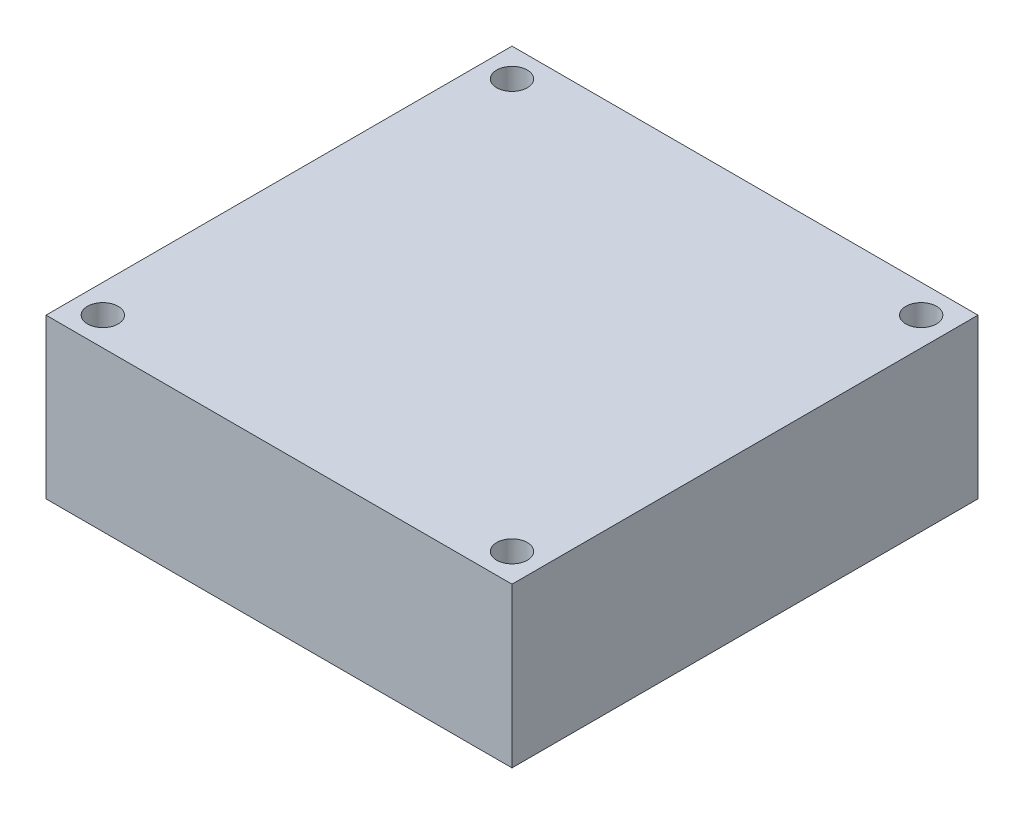
ISO-10303-21;
HEADER;
FILE_DESCRIPTION(('STEP AP214'),'2;1');
FILE_NAME('part.step','',(''),(''),'','','');
FILE_SCHEMA(('AUTOMOTIVE_DESIGN { 1 0 10303 214 1 1 1 1 }'));
ENDSEC;
DATA;
#1=APPLICATION_CONTEXT('core data for automotive mechanical design processes');
#2=APPLICATION_PROTOCOL_DEFINITION('international standard','automotive_design',2000,#1);
#3=PRODUCT_CONTEXT('',#1,'mechanical');
#4=PRODUCT('Part','Part','',(#3));
#5=PRODUCT_RELATED_PRODUCT_CATEGORY('part','',(#4));
#6=PRODUCT_DEFINITION_FORMATION('','',#4);
#7=PRODUCT_DEFINITION_CONTEXT('part definition',#1,'design');
#8=PRODUCT_DEFINITION('design','',#6,#7);
#9=PRODUCT_DEFINITION_SHAPE('','',#8);
#10=(LENGTH_UNIT() NAMED_UNIT(*) SI_UNIT(.MILLI.,.METRE.));
#11=(NAMED_UNIT(*) PLANE_ANGLE_UNIT() SI_UNIT($,.RADIAN.));
#12=(NAMED_UNIT(*) SI_UNIT($,.STERADIAN.) SOLID_ANGLE_UNIT());
#13=UNCERTAINTY_MEASURE_WITH_UNIT(LENGTH_MEASURE(1.E-05),#10,'distance_accuracy_value','');
#14=(GEOMETRIC_REPRESENTATION_CONTEXT(3) GLOBAL_UNCERTAINTY_ASSIGNED_CONTEXT((#13)) GLOBAL_UNIT_ASSIGNED_CONTEXT((#10,
#11,#12)) REPRESENTATION_CONTEXT('',''));
#15=CARTESIAN_POINT('',(0.,0.,0.));
#16=DIRECTION('',(0.,0.,1.));
#17=DIRECTION('',(1.,0.,0.));
#18=AXIS2_PLACEMENT_3D('',#15,#16,#17);
#19=CARTESIAN_POINT('',(-20.5,14.,20.5));
#20=DIRECTION('',(0.,0.,-1.));
#21=DIRECTION('',(-1.,0.,0.));
#22=AXIS2_PLACEMENT_3D('',#19,#20,#21);
#23=PLANE('',#22);
#24=DIRECTION('',(1.,0.,0.));
#25=VECTOR('',#24,1.);
#26=CARTESIAN_POINT('',(-20.5,0.,20.5));
#27=LINE('',#26,#25);
#28=CARTESIAN_POINT('',(-20.5,0.,20.5));
#29=VERTEX_POINT('',#28);
#30=CARTESIAN_POINT('',(20.5,0.,20.5));
#31=VERTEX_POINT('',#30);
#32=EDGE_CURVE('E113',#29,#31,#27,.T.);
#33=ORIENTED_EDGE('',*,*,#32,.T.);
#34=DIRECTION('',(0.,-1.,0.));
#35=VECTOR('',#34,1.);
#36=CARTESIAN_POINT('',(20.5,14.,20.5));
#37=LINE('',#36,#35);
#38=CARTESIAN_POINT('',(20.5,14.,20.5));
#39=VERTEX_POINT('',#38);
#40=EDGE_CURVE('E11',#39,#31,#37,.T.);
#41=ORIENTED_EDGE('',*,*,#40,.F.);
#42=DIRECTION('',(1.,0.,0.));
#43=VECTOR('',#42,1.);
#44=CARTESIAN_POINT('',(-20.5,14.,20.5));
#45=LINE('',#44,#43);
#46=CARTESIAN_POINT('',(-20.5,14.,20.5));
#47=VERTEX_POINT('',#46);
#48=EDGE_CURVE('E95',#47,#39,#45,.T.);
#49=ORIENTED_EDGE('',*,*,#48,.F.);
#50=DIRECTION('',(0.,-1.,0.));
#51=VECTOR('',#50,1.);
#52=CARTESIAN_POINT('',(-20.5,14.,20.5));
#53=LINE('',#52,#51);
#54=EDGE_CURVE('E62',#47,#29,#53,.T.);
#55=ORIENTED_EDGE('',*,*,#54,.T.);
#56=EDGE_LOOP('',(#33,#41,#49,#55));
#57=FACE_BOUND('',#56,.T.);
#58=ADVANCED_FACE('F45',(#57),#23,.F.);
#59=CARTESIAN_POINT('',(20.5,14.,20.5));
#60=DIRECTION('',(-1.,0.,0.));
#61=DIRECTION('',(0.,0.,1.));
#62=AXIS2_PLACEMENT_3D('',#59,#60,#61);
#63=PLANE('',#62);
#64=DIRECTION('',(0.,0.,-1.));
#65=VECTOR('',#64,1.);
#66=CARTESIAN_POINT('',(20.5,0.,20.5));
#67=LINE('',#66,#65);
#68=CARTESIAN_POINT('',(20.5,0.,-20.5));
#69=VERTEX_POINT('',#68);
#70=EDGE_CURVE('E101',#31,#69,#67,.T.);
#71=ORIENTED_EDGE('',*,*,#70,.T.);
#72=DIRECTION('',(0.,-1.,0.));
#73=VECTOR('',#72,1.);
#74=CARTESIAN_POINT('',(20.5,14.,-20.5));
#75=LINE('',#74,#73);
#76=CARTESIAN_POINT('',(20.5,14.,-20.5));
#77=VERTEX_POINT('',#76);
#78=EDGE_CURVE('E54',#77,#69,#75,.T.);
#79=ORIENTED_EDGE('',*,*,#78,.F.);
#80=DIRECTION('',(0.,0.,-1.));
#81=VECTOR('',#80,1.);
#82=CARTESIAN_POINT('',(20.5,14.,20.5));
#83=LINE('',#82,#81);
#84=EDGE_CURVE('E87',#39,#77,#83,.T.);
#85=ORIENTED_EDGE('',*,*,#84,.F.);
#86=ORIENTED_EDGE('',*,*,#40,.T.);
#87=EDGE_LOOP('',(#71,#79,#85,#86));
#88=FACE_BOUND('',#87,.T.);
#89=ADVANCED_FACE('F100',(#88),#63,.F.);
#90=CARTESIAN_POINT('',(-20.5,14.,-20.5));
#91=DIRECTION('',(0.,0.,-1.));
#92=DIRECTION('',(-1.,0.,0.));
#93=AXIS2_PLACEMENT_3D('',#90,#91,#92);
#94=PLANE('',#93);
#95=DIRECTION('',(1.,0.,0.));
#96=VECTOR('',#95,1.);
#97=CARTESIAN_POINT('',(-20.5,0.,-20.5));
#98=LINE('',#97,#96);
#99=CARTESIAN_POINT('',(-20.5,0.,-20.5));
#100=VERTEX_POINT('',#99);
#101=EDGE_CURVE('E119',#100,#69,#98,.T.);
#102=ORIENTED_EDGE('',*,*,#101,.F.);
#103=DIRECTION('',(0.,-1.,0.));
#104=VECTOR('',#103,1.);
#105=CARTESIAN_POINT('',(-20.5,14.,-20.5));
#106=LINE('',#105,#104);
#107=CARTESIAN_POINT('',(-20.5,14.,-20.5));
#108=VERTEX_POINT('',#107);
#109=EDGE_CURVE('E76',#108,#100,#106,.T.);
#110=ORIENTED_EDGE('',*,*,#109,.F.);
#111=DIRECTION('',(1.,0.,0.));
#112=VECTOR('',#111,1.);
#113=CARTESIAN_POINT('',(-20.5,14.,-20.5));
#114=LINE('',#113,#112);
#115=EDGE_CURVE('E94',#108,#77,#114,.T.);
#116=ORIENTED_EDGE('',*,*,#115,.T.);
#117=ORIENTED_EDGE('',*,*,#78,.T.);
#118=EDGE_LOOP('',(#102,#110,#116,#117));
#119=FACE_BOUND('',#118,.T.);
#120=ADVANCED_FACE('F105',(#119),#94,.T.);
#121=CARTESIAN_POINT('',(-20.5,14.,20.5));
#122=DIRECTION('',(-1.,0.,0.));
#123=DIRECTION('',(0.,0.,1.));
#124=AXIS2_PLACEMENT_3D('',#121,#122,#123);
#125=PLANE('',#124);
#126=DIRECTION('',(0.,0.,-1.));
#127=VECTOR('',#126,1.);
#128=CARTESIAN_POINT('',(-20.5,0.,20.5));
#129=LINE('',#128,#127);
#130=EDGE_CURVE('E122',#29,#100,#129,.T.);
#131=ORIENTED_EDGE('',*,*,#130,.F.);
#132=ORIENTED_EDGE('',*,*,#54,.F.);
#133=DIRECTION('',(0.,0.,-1.));
#134=VECTOR('',#133,1.);
#135=CARTESIAN_POINT('',(-20.5,14.,20.5));
#136=LINE('',#135,#134);
#137=EDGE_CURVE('E107',#47,#108,#136,.T.);
#138=ORIENTED_EDGE('',*,*,#137,.T.);
#139=ORIENTED_EDGE('',*,*,#109,.T.);
#140=EDGE_LOOP('',(#131,#132,#138,#139));
#141=FACE_BOUND('',#140,.T.);
#142=ADVANCED_FACE('F169',(#141),#125,.T.);
#143=CARTESIAN_POINT('',(0.,14.,0.));
#144=DIRECTION('',(0.,1.,0.));
#145=DIRECTION('',(0.,0.,1.));
#146=AXIS2_PLACEMENT_3D('',#143,#144,#145);
#147=PLANE('',#146);
#148=CARTESIAN_POINT('',(-18.0000000000002,14.,17.9999999999998));
#149=DIRECTION('',(0.,1.,0.));
#150=DIRECTION('',(0.,0.,1.));
#151=AXIS2_PLACEMENT_3D('',#148,#149,#150);
#152=CIRCLE('',#151,1.35);
#153=CARTESIAN_POINT('',(-18.0000000000002,14.,19.3499999999998));
#154=VERTEX_POINT('',#153);
#155=EDGE_CURVE('E144',#154,#154,#152,.T.);
#156=ORIENTED_EDGE('',*,*,#155,.F.);
#157=EDGE_LOOP('',(#156));
#158=FACE_BOUND('',#157,.T.);
#159=CARTESIAN_POINT('',(17.9999999999999,14.,18.0000000000001));
#160=DIRECTION('',(0.,1.,0.));
#161=DIRECTION('',(0.,0.,1.));
#162=AXIS2_PLACEMENT_3D('',#159,#160,#161);
#163=CIRCLE('',#162,1.35);
#164=CARTESIAN_POINT('',(17.9999999999999,14.,19.3500000000001));
#165=VERTEX_POINT('',#164);
#166=EDGE_CURVE('E152',#165,#165,#163,.T.);
#167=ORIENTED_EDGE('',*,*,#166,.F.);
#168=EDGE_LOOP('',(#167));
#169=FACE_BOUND('',#168,.T.);
#170=CARTESIAN_POINT('',(18.0000000000001,14.,-17.9999999999999));
#171=DIRECTION('',(0.,1.,0.));
#172=DIRECTION('',(0.,0.,1.));
#173=AXIS2_PLACEMENT_3D('',#170,#171,#172);
#174=CIRCLE('',#173,1.35);
#175=CARTESIAN_POINT('',(18.0000000000001,14.,-16.6499999999999));
#176=VERTEX_POINT('',#175);
#177=EDGE_CURVE('E136',#176,#176,#174,.T.);
#178=ORIENTED_EDGE('',*,*,#177,.F.);
#179=EDGE_LOOP('',(#178));
#180=FACE_BOUND('',#179,.T.);
#181=CARTESIAN_POINT('',(-18.,14.,-18.));
#182=DIRECTION('',(0.,1.,0.));
#183=DIRECTION('',(0.,0.,1.));
#184=AXIS2_PLACEMENT_3D('',#181,#182,#183);
#185=CIRCLE('',#184,1.35);
#186=CARTESIAN_POINT('',(-18.,14.,-16.65));
#187=VERTEX_POINT('',#186);
#188=EDGE_CURVE('E132',#187,#187,#185,.T.);
#189=ORIENTED_EDGE('',*,*,#188,.F.);
#190=EDGE_LOOP('',(#189));
#191=FACE_BOUND('',#190,.T.);
#192=ORIENTED_EDGE('',*,*,#48,.T.);
#193=ORIENTED_EDGE('',*,*,#84,.T.);
#194=ORIENTED_EDGE('',*,*,#115,.F.);
#195=ORIENTED_EDGE('',*,*,#137,.F.);
#196=EDGE_LOOP('',(#192,#193,#194,#195));
#197=FACE_BOUND('',#196,.T.);
#198=ADVANCED_FACE('F91',(#158,#169,#180,#191,#197),#147,.T.);
#199=CARTESIAN_POINT('',(0.,0.,0.));
#200=DIRECTION('',(0.,1.,0.));
#201=DIRECTION('',(0.,0.,1.));
#202=AXIS2_PLACEMENT_3D('',#199,#200,#201);
#203=PLANE('',#202);
#204=CARTESIAN_POINT('',(-18.0000000000002,0.,17.9999999999998));
#205=DIRECTION('',(0.,1.,0.));
#206=DIRECTION('',(0.,0.,1.));
#207=AXIS2_PLACEMENT_3D('',#204,#205,#206);
#208=CIRCLE('',#207,1.35);
#209=CARTESIAN_POINT('',(-18.0000000000002,0.,19.3499999999998));
#210=VERTEX_POINT('',#209);
#211=EDGE_CURVE('E140',#210,#210,#208,.T.);
#212=ORIENTED_EDGE('',*,*,#211,.T.);
#213=EDGE_LOOP('',(#212));
#214=FACE_BOUND('',#213,.T.);
#215=CARTESIAN_POINT('',(17.9999999999999,0.,18.0000000000001));
#216=DIRECTION('',(0.,1.,0.));
#217=DIRECTION('',(0.,0.,1.));
#218=AXIS2_PLACEMENT_3D('',#215,#216,#217);
#219=CIRCLE('',#218,1.35);
#220=CARTESIAN_POINT('',(17.9999999999999,0.,19.3500000000001));
#221=VERTEX_POINT('',#220);
#222=EDGE_CURVE('E148',#221,#221,#219,.T.);
#223=ORIENTED_EDGE('',*,*,#222,.T.);
#224=EDGE_LOOP('',(#223));
#225=FACE_BOUND('',#224,.T.);
#226=CARTESIAN_POINT('',(18.0000000000001,0.,-17.9999999999999));
#227=DIRECTION('',(0.,1.,0.));
#228=DIRECTION('',(0.,0.,1.));
#229=AXIS2_PLACEMENT_3D('',#226,#227,#228);
#230=CIRCLE('',#229,1.35);
#231=CARTESIAN_POINT('',(18.0000000000001,0.,-16.6499999999999));
#232=VERTEX_POINT('',#231);
#233=EDGE_CURVE('E156',#232,#232,#230,.T.);
#234=ORIENTED_EDGE('',*,*,#233,.T.);
#235=EDGE_LOOP('',(#234));
#236=FACE_BOUND('',#235,.T.);
#237=CARTESIAN_POINT('',(-18.,0.,-18.));
#238=DIRECTION('',(0.,1.,0.));
#239=DIRECTION('',(0.,0.,1.));
#240=AXIS2_PLACEMENT_3D('',#237,#238,#239);
#241=CIRCLE('',#240,1.35);
#242=CARTESIAN_POINT('',(-18.,0.,-16.65));
#243=VERTEX_POINT('',#242);
#244=EDGE_CURVE('E116',#243,#243,#241,.T.);
#245=ORIENTED_EDGE('',*,*,#244,.T.);
#246=EDGE_LOOP('',(#245));
#247=FACE_BOUND('',#246,.T.);
#248=ORIENTED_EDGE('',*,*,#32,.F.);
#249=ORIENTED_EDGE('',*,*,#130,.T.);
#250=ORIENTED_EDGE('',*,*,#101,.T.);
#251=ORIENTED_EDGE('',*,*,#70,.F.);
#252=EDGE_LOOP('',(#248,#249,#250,#251));
#253=FACE_BOUND('',#252,.T.);
#254=ADVANCED_FACE('F168',(#214,#225,#236,#247,#253),#203,.F.);
#255=CARTESIAN_POINT('',(-18.,0.,-18.));
#256=DIRECTION('',(0.,1.,0.));
#257=DIRECTION('',(0.,0.,1.));
#258=AXIS2_PLACEMENT_3D('',#255,#256,#257);
#259=CYLINDRICAL_SURFACE('',#258,1.35);
#260=ORIENTED_EDGE('',*,*,#244,.F.);
#261=EDGE_LOOP('',(#260));
#262=FACE_BOUND('',#261,.T.);
#263=ORIENTED_EDGE('',*,*,#188,.T.);
#264=EDGE_LOOP('',(#263));
#265=FACE_BOUND('',#264,.T.);
#266=ADVANCED_FACE('F174',(#262,#265),#259,.F.);
#267=CARTESIAN_POINT('',(18.0000000000001,0.,-17.9999999999999));
#268=DIRECTION('',(0.,1.,0.));
#269=DIRECTION('',(0.,0.,1.));
#270=AXIS2_PLACEMENT_3D('',#267,#268,#269);
#271=CYLINDRICAL_SURFACE('',#270,1.35);
#272=ORIENTED_EDGE('',*,*,#233,.F.);
#273=EDGE_LOOP('',(#272));
#274=FACE_BOUND('',#273,.T.);
#275=ORIENTED_EDGE('',*,*,#177,.T.);
#276=EDGE_LOOP('',(#275));
#277=FACE_BOUND('',#276,.T.);
#278=ADVANCED_FACE('F164',(#274,#277),#271,.F.);
#279=CARTESIAN_POINT('',(17.9999999999999,0.,18.0000000000001));
#280=DIRECTION('',(0.,1.,0.));
#281=DIRECTION('',(0.,0.,1.));
#282=AXIS2_PLACEMENT_3D('',#279,#280,#281);
#283=CYLINDRICAL_SURFACE('',#282,1.35);
#284=ORIENTED_EDGE('',*,*,#222,.F.);
#285=EDGE_LOOP('',(#284));
#286=FACE_BOUND('',#285,.T.);
#287=ORIENTED_EDGE('',*,*,#166,.T.);
#288=EDGE_LOOP('',(#287));
#289=FACE_BOUND('',#288,.T.);
#290=ADVANCED_FACE('F182',(#286,#289),#283,.F.);
#291=CARTESIAN_POINT('',(-18.0000000000002,0.,17.9999999999998));
#292=DIRECTION('',(0.,1.,0.));
#293=DIRECTION('',(0.,0.,1.));
#294=AXIS2_PLACEMENT_3D('',#291,#292,#293);
#295=CYLINDRICAL_SURFACE('',#294,1.35);
#296=ORIENTED_EDGE('',*,*,#211,.F.);
#297=EDGE_LOOP('',(#296));
#298=FACE_BOUND('',#297,.T.);
#299=ORIENTED_EDGE('',*,*,#155,.T.);
#300=EDGE_LOOP('',(#299));
#301=FACE_BOUND('',#300,.T.);
#302=ADVANCED_FACE('F243',(#298,#301),#295,.F.);
#303=CLOSED_SHELL('',(#58,#89,#120,#142,#198,#254,#266,#278,#290,#302));
#304=MANIFOLD_SOLID_BREP('B2',#303);
#305=ADVANCED_BREP_SHAPE_REPRESENTATION('',(#18,#304),#14);
#306=SHAPE_DEFINITION_REPRESENTATION(#9,#305);
ENDSEC;
END-ISO-10303-21;
